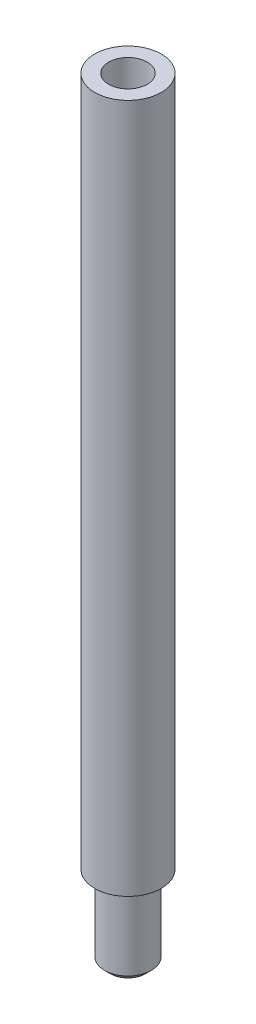
ISO-10303-21;
HEADER;
FILE_DESCRIPTION(('STEP AP214'),'2;1');
FILE_NAME('part.step','',(''),(''),'','','');
FILE_SCHEMA(('AUTOMOTIVE_DESIGN { 1 0 10303 214 1 1 1 1 }'));
ENDSEC;
DATA;
#1=APPLICATION_CONTEXT('core data for automotive mechanical design processes');
#2=APPLICATION_PROTOCOL_DEFINITION('international standard','automotive_design',2000,#1);
#3=PRODUCT_CONTEXT('',#1,'mechanical');
#4=PRODUCT('Part','Part','',(#3));
#5=PRODUCT_RELATED_PRODUCT_CATEGORY('part','',(#4));
#6=PRODUCT_DEFINITION_FORMATION('','',#4);
#7=PRODUCT_DEFINITION_CONTEXT('part definition',#1,'design');
#8=PRODUCT_DEFINITION('design','',#6,#7);
#9=PRODUCT_DEFINITION_SHAPE('','',#8);
#10=(LENGTH_UNIT() NAMED_UNIT(*) SI_UNIT(.MILLI.,.METRE.));
#11=(NAMED_UNIT(*) PLANE_ANGLE_UNIT() SI_UNIT($,.RADIAN.));
#12=(NAMED_UNIT(*) SI_UNIT($,.STERADIAN.) SOLID_ANGLE_UNIT());
#13=UNCERTAINTY_MEASURE_WITH_UNIT(LENGTH_MEASURE(1.E-05),#10,'distance_accuracy_value','');
#14=(GEOMETRIC_REPRESENTATION_CONTEXT(3) GLOBAL_UNCERTAINTY_ASSIGNED_CONTEXT((#13)) GLOBAL_UNIT_ASSIGNED_CONTEXT((#10,
#11,#12)) REPRESENTATION_CONTEXT('',''));
#15=CARTESIAN_POINT('',(0.,0.,0.));
#16=DIRECTION('',(0.,0.,1.));
#17=DIRECTION('',(1.,0.,0.));
#18=AXIS2_PLACEMENT_3D('',#15,#16,#17);
#19=CARTESIAN_POINT('',(0.,59.,0.));
#20=DIRECTION('',(0.,-1.,0.));
#21=DIRECTION('',(0.,0.,-1.));
#22=AXIS2_PLACEMENT_3D('',#19,#20,#21);
#23=CYLINDRICAL_SURFACE('',#22,2.85);
#24=CARTESIAN_POINT('',(0.,59.,0.));
#25=DIRECTION('',(0.,1.,0.));
#26=DIRECTION('',(0.,0.,1.));
#27=AXIS2_PLACEMENT_3D('',#24,#25,#26);
#28=CIRCLE('',#27,2.85);
#29=CARTESIAN_POINT('',(0.,59.,2.85));
#30=VERTEX_POINT('',#29);
#31=EDGE_CURVE('E67',#30,#30,#28,.T.);
#32=ORIENTED_EDGE('',*,*,#31,.F.);
#33=EDGE_LOOP('',(#32));
#34=FACE_BOUND('',#33,.T.);
#35=CARTESIAN_POINT('',(0.,0.,0.));
#36=DIRECTION('',(0.,1.,0.));
#37=DIRECTION('',(0.,0.,1.));
#38=AXIS2_PLACEMENT_3D('',#35,#36,#37);
#39=CIRCLE('',#38,2.85);
#40=CARTESIAN_POINT('',(0.,0.,2.85));
#41=VERTEX_POINT('',#40);
#42=EDGE_CURVE('E62',#41,#41,#39,.T.);
#43=ORIENTED_EDGE('',*,*,#42,.T.);
#44=EDGE_LOOP('',(#43));
#45=FACE_BOUND('',#44,.T.);
#46=ADVANCED_FACE('F38',(#34,#45),#23,.T.);
#47=CARTESIAN_POINT('',(0.,59.,0.));
#48=DIRECTION('',(0.,1.,0.));
#49=DIRECTION('',(0.,0.,1.));
#50=AXIS2_PLACEMENT_3D('',#47,#48,#49);
#51=PLANE('',#50);
#52=CARTESIAN_POINT('',(0.,59.,0.));
#53=DIRECTION('',(0.,1.,0.));
#54=DIRECTION('',(0.,0.,1.));
#55=AXIS2_PLACEMENT_3D('',#52,#53,#54);
#56=CIRCLE('',#55,1.64999999999999);
#57=CARTESIAN_POINT('',(0.,59.,1.64999999999999));
#58=VERTEX_POINT('',#57);
#59=EDGE_CURVE('E59',#58,#58,#56,.T.);
#60=ORIENTED_EDGE('',*,*,#59,.F.);
#61=EDGE_LOOP('',(#60));
#62=FACE_BOUND('',#61,.T.);
#63=ORIENTED_EDGE('',*,*,#31,.T.);
#64=EDGE_LOOP('',(#63));
#65=FACE_BOUND('',#64,.T.);
#66=ADVANCED_FACE('F85',(#62,#65),#51,.T.);
#67=CARTESIAN_POINT('',(0.,0.,0.));
#68=DIRECTION('',(0.,1.,0.));
#69=DIRECTION('',(0.,0.,1.));
#70=AXIS2_PLACEMENT_3D('',#67,#68,#69);
#71=PLANE('',#70);
#72=CARTESIAN_POINT('',(0.,0.,0.));
#73=DIRECTION('',(0.,1.,0.));
#74=DIRECTION('',(0.,0.,1.));
#75=AXIS2_PLACEMENT_3D('',#72,#73,#74);
#76=CIRCLE('',#75,2.);
#77=CARTESIAN_POINT('',(0.,0.,2.));
#78=VERTEX_POINT('',#77);
#79=EDGE_CURVE('E58',#78,#78,#76,.T.);
#80=ORIENTED_EDGE('',*,*,#79,.T.);
#81=EDGE_LOOP('',(#80));
#82=FACE_BOUND('',#81,.T.);
#83=ORIENTED_EDGE('',*,*,#42,.F.);
#84=EDGE_LOOP('',(#83));
#85=FACE_BOUND('',#84,.T.);
#86=ADVANCED_FACE('F90',(#82,#85),#71,.F.);
#87=CARTESIAN_POINT('',(0.,-7.,0.));
#88=DIRECTION('',(0.,1.,0.));
#89=DIRECTION('',(0.,0.,1.));
#90=AXIS2_PLACEMENT_3D('',#87,#88,#89);
#91=CYLINDRICAL_SURFACE('',#90,2.);
#92=CARTESIAN_POINT('',(0.,-6.49999999999998,0.));
#93=DIRECTION('',(0.,1.,0.));
#94=DIRECTION('',(0.,0.,1.));
#95=AXIS2_PLACEMENT_3D('',#92,#93,#94);
#96=CIRCLE('',#95,2.);
#97=CARTESIAN_POINT('',(0.,-6.49999999999998,2.));
#98=VERTEX_POINT('',#97);
#99=EDGE_CURVE('E45',#98,#98,#96,.T.);
#100=ORIENTED_EDGE('',*,*,#99,.T.);
#101=EDGE_LOOP('',(#100));
#102=FACE_BOUND('',#101,.T.);
#103=ORIENTED_EDGE('',*,*,#79,.F.);
#104=EDGE_LOOP('',(#103));
#105=FACE_BOUND('',#104,.T.);
#106=ADVANCED_FACE('F74',(#102,#105),#91,.T.);
#107=CARTESIAN_POINT('',(0.,-7.,0.));
#108=DIRECTION('',(0.,1.,0.));
#109=DIRECTION('',(0.,0.,1.));
#110=AXIS2_PLACEMENT_3D('',#107,#108,#109);
#111=PLANE('',#110);
#112=CARTESIAN_POINT('',(0.,-7.,0.));
#113=DIRECTION('',(0.,1.,0.));
#114=DIRECTION('',(0.,0.,1.));
#115=AXIS2_PLACEMENT_3D('',#112,#113,#114);
#116=CIRCLE('',#115,1.49999999999998);
#117=CARTESIAN_POINT('',(0.,-7.,1.49999999999998));
#118=VERTEX_POINT('',#117);
#119=EDGE_CURVE('E11',#118,#118,#116,.F.);
#120=ORIENTED_EDGE('',*,*,#119,.T.);
#121=EDGE_LOOP('',(#120));
#122=FACE_BOUND('',#121,.T.);
#123=ADVANCED_FACE('F52',(#122),#111,.F.);
#124=CARTESIAN_POINT('',(0.,48.9,0.));
#125=DIRECTION('',(0.,1.,0.));
#126=DIRECTION('',(0.,0.,1.));
#127=AXIS2_PLACEMENT_3D('',#124,#125,#126);
#128=CONICAL_SURFACE('',#127,1.65,1.02974425867665);
#129=CARTESIAN_POINT('',(0.,47.9085799786045,0.));
#130=VERTEX_POINT('',#129);
#131=VERTEX_LOOP('',#130);
#132=FACE_BOUND('',#131,.T.);
#133=CARTESIAN_POINT('',(0.,48.9,0.));
#134=DIRECTION('',(0.,1.,0.));
#135=DIRECTION('',(0.,0.,1.));
#136=AXIS2_PLACEMENT_3D('',#133,#134,#135);
#137=CIRCLE('',#136,1.65);
#138=CARTESIAN_POINT('',(0.,48.9,1.65));
#139=VERTEX_POINT('',#138);
#140=EDGE_CURVE('E56',#139,#139,#137,.T.);
#141=ORIENTED_EDGE('',*,*,#140,.T.);
#142=EDGE_LOOP('',(#141));
#143=FACE_BOUND('',#142,.T.);
#144=ADVANCED_FACE('F48',(#132,#143),#128,.F.);
#145=CARTESIAN_POINT('',(0.,59.,0.));
#146=DIRECTION('',(0.,1.,0.));
#147=DIRECTION('',(0.,0.,1.));
#148=AXIS2_PLACEMENT_3D('',#145,#146,#147);
#149=CYLINDRICAL_SURFACE('',#148,1.64999999999999);
#150=ORIENTED_EDGE('',*,*,#140,.F.);
#151=EDGE_LOOP('',(#150));
#152=FACE_BOUND('',#151,.T.);
#153=ORIENTED_EDGE('',*,*,#59,.T.);
#154=EDGE_LOOP('',(#153));
#155=FACE_BOUND('',#154,.T.);
#156=ADVANCED_FACE('F51',(#152,#155),#149,.F.);
#157=CARTESIAN_POINT('',(0.,-6.49999999999998,0.));
#158=DIRECTION('',(0.,1.,0.));
#159=DIRECTION('',(0.,0.,1.));
#160=AXIS2_PLACEMENT_3D('',#157,#158,#159);
#161=CONICAL_SURFACE('',#160,2.,0.785398163397448);
#162=CARTESIAN_POINT('',(0.,-7.,1.49999999999998));
#163=CARTESIAN_POINT('',(0.,-6.99479166666667,1.50520833333331));
#164=CARTESIAN_POINT('',(0.,-6.98958333333333,1.51041666666665));
#165=CARTESIAN_POINT('',(0.,-6.97916666666667,1.52083333333331));
#166=CARTESIAN_POINT('',(0.,-6.97395833333333,1.52604166666665));
#167=CARTESIAN_POINT('',(0.,-6.96354166666667,1.53645833333331));
#168=CARTESIAN_POINT('',(0.,-6.95833333333333,1.54166666666665));
#169=CARTESIAN_POINT('',(0.,-6.94791666666666,1.55208333333332));
#170=CARTESIAN_POINT('',(0.,-6.94270833333333,1.55729166666665));
#171=CARTESIAN_POINT('',(0.,-6.93229166666666,1.56770833333332));
#172=CARTESIAN_POINT('',(0.,-6.92708333333333,1.57291666666665));
#173=CARTESIAN_POINT('',(0.,-6.91666666666666,1.58333333333332));
#174=CARTESIAN_POINT('',(0.,-6.91145833333333,1.58854166666665));
#175=CARTESIAN_POINT('',(0.,-6.90104166666666,1.59895833333332));
#176=CARTESIAN_POINT('',(0.,-6.89583333333333,1.60416666666665));
#177=CARTESIAN_POINT('',(0.,-6.88541666666666,1.61458333333332));
#178=CARTESIAN_POINT('',(0.,-6.88020833333333,1.61979166666665));
#179=CARTESIAN_POINT('',(0.,-6.86979166666666,1.63020833333332));
#180=CARTESIAN_POINT('',(0.,-6.86458333333333,1.63541666666665));
#181=CARTESIAN_POINT('',(0.,-6.85416666666666,1.64583333333332));
#182=CARTESIAN_POINT('',(0.,-6.84895833333333,1.65104166666665));
#183=CARTESIAN_POINT('',(0.,-6.83854166666666,1.66145833333332));
#184=CARTESIAN_POINT('',(0.,-6.83333333333333,1.66666666666665));
#185=CARTESIAN_POINT('',(0.,-6.82291666666666,1.67708333333332));
#186=CARTESIAN_POINT('',(0.,-6.81770833333333,1.68229166666665));
#187=CARTESIAN_POINT('',(0.,-6.80729166666666,1.69270833333332));
#188=CARTESIAN_POINT('',(0.,-6.80208333333333,1.69791666666665));
#189=CARTESIAN_POINT('',(0.,-6.79166666666666,1.70833333333332));
#190=CARTESIAN_POINT('',(0.,-6.78645833333333,1.71354166666666));
#191=CARTESIAN_POINT('',(0.,-6.77604166666666,1.72395833333332));
#192=CARTESIAN_POINT('',(0.,-6.77083333333333,1.72916666666666));
#193=CARTESIAN_POINT('',(0.,-6.76041666666666,1.73958333333332));
#194=CARTESIAN_POINT('',(0.,-6.75520833333332,1.74479166666666));
#195=CARTESIAN_POINT('',(0.,-6.74479166666666,1.75520833333332));
#196=CARTESIAN_POINT('',(0.,-6.73958333333332,1.76041666666666));
#197=CARTESIAN_POINT('',(0.,-6.72916666666666,1.77083333333332));
#198=CARTESIAN_POINT('',(0.,-6.72395833333332,1.77604166666666));
#199=CARTESIAN_POINT('',(0.,-6.71354166666666,1.78645833333332));
#200=CARTESIAN_POINT('',(0.,-6.70833333333332,1.79166666666666));
#201=CARTESIAN_POINT('',(0.,-6.69791666666666,1.80208333333333));
#202=CARTESIAN_POINT('',(0.,-6.69270833333332,1.80729166666666));
#203=CARTESIAN_POINT('',(0.,-6.68229166666665,1.81770833333333));
#204=CARTESIAN_POINT('',(0.,-6.67708333333332,1.82291666666666));
#205=CARTESIAN_POINT('',(0.,-6.66666666666665,1.83333333333333));
#206=CARTESIAN_POINT('',(0.,-6.66145833333332,1.83854166666666));
#207=CARTESIAN_POINT('',(0.,-6.65104166666665,1.84895833333333));
#208=CARTESIAN_POINT('',(0.,-6.64583333333332,1.85416666666666));
#209=CARTESIAN_POINT('',(0.,-6.63541666666665,1.86458333333333));
#210=CARTESIAN_POINT('',(0.,-6.63020833333332,1.86979166666666));
#211=CARTESIAN_POINT('',(0.,-6.61979166666665,1.88020833333333));
#212=CARTESIAN_POINT('',(0.,-6.61458333333332,1.88541666666666));
#213=CARTESIAN_POINT('',(0.,-6.60416666666665,1.89583333333333));
#214=CARTESIAN_POINT('',(0.,-6.59895833333332,1.90104166666666));
#215=CARTESIAN_POINT('',(0.,-6.58854166666665,1.91145833333333));
#216=CARTESIAN_POINT('',(0.,-6.58333333333332,1.91666666666666));
#217=CARTESIAN_POINT('',(0.,-6.57291666666665,1.92708333333333));
#218=CARTESIAN_POINT('',(0.,-6.56770833333332,1.93229166666666));
#219=CARTESIAN_POINT('',(0.,-6.55729166666665,1.94270833333333));
#220=CARTESIAN_POINT('',(0.,-6.55208333333332,1.94791666666666));
#221=CARTESIAN_POINT('',(0.,-6.54166666666665,1.95833333333333));
#222=CARTESIAN_POINT('',(0.,-6.53645833333332,1.96354166666666));
#223=CARTESIAN_POINT('',(0.,-6.52604166666665,1.97395833333333));
#224=CARTESIAN_POINT('',(0.,-6.52083333333332,1.97916666666667));
#225=CARTESIAN_POINT('',(0.,-6.51041666666665,1.98958333333333));
#226=CARTESIAN_POINT('',(0.,-6.50520833333331,1.99479166666667));
#227=CARTESIAN_POINT('',(0.,-6.49999999999998,2.));
#228=B_SPLINE_CURVE_WITH_KNOTS('',3,(#162,#163,#164,#165,#166,#167,#168,#169,#170,#171,#172,
#173,#174,#175,#176,#177,#178,#179,#180,#181,#182,#183,#184,#185,#186,#187,#188,#189,#190,#191,
#192,#193,#194,#195,#196,#197,#198,#199,#200,#201,#202,#203,#204,#205,#206,#207,#208,#209,#210,
#211,#212,#213,#214,#215,#216,#217,#218,#219,#220,#221,#222,#223,#224,#225,#226,#227),
.UNSPECIFIED.,.F.,.F.,(4,2,2,2,2,2,2,2,2,2,2,2,2,2,2,2,2,2,2,2,2,2,2,2,2,2,2,2,2,2,2,2,4),(0.,
0.0220970869120801,0.0441941738241608,0.0662912607362414,0.0883883476483214,0.110485434560402,
0.132582521472483,0.154679608384563,0.176776695296643,0.198873782208724,0.220970869120804,
0.243067956032885,0.265165042944966,0.287262129857046,0.309359216769126,0.331456303681207,
0.353553390593288,0.375650477505368,0.397747564417448,0.419844651329529,0.441941738241609,
0.46403882515369,0.48613591206577,0.50823299897785,0.530330085889931,0.552427172802012,
0.574524259714092,0.596621346626172,0.618718433538253,0.640815520450333,0.662912607362414,
0.685009694274495,0.707106781186575),.UNSPECIFIED.);
#229=EDGE_CURVE('BSEAM40',#118,#98,#228,.T.);
#230=ORIENTED_EDGE('',*,*,#119,.F.);
#231=ORIENTED_EDGE('',*,*,#99,.F.);
#232=ORIENTED_EDGE('',*,*,#229,.T.);
#233=ORIENTED_EDGE('',*,*,#229,.F.);
#234=EDGE_LOOP('',(#230,#232,#231,#233));
#235=FACE_BOUND('',#234,.T.);
#236=ADVANCED_FACE('F40',(#235),#161,.T.);
#237=CLOSED_SHELL('',(#46,#66,#86,#106,#123,#144,#156,#236));
#238=MANIFOLD_SOLID_BREP('B2',#237);
#239=ADVANCED_BREP_SHAPE_REPRESENTATION('',(#18,#238),#14);
#240=SHAPE_DEFINITION_REPRESENTATION(#9,#239);
ENDSEC;
END-ISO-10303-21;
